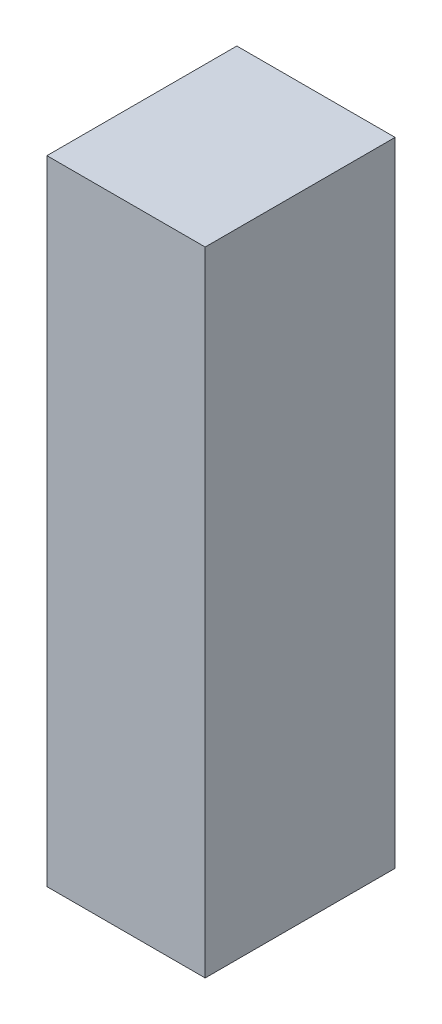
ISO-10303-21;
HEADER;
FILE_DESCRIPTION(('STEP AP214'),'2;1');
FILE_NAME('part.step','',(''),(''),'','','');
FILE_SCHEMA(('AUTOMOTIVE_DESIGN { 1 0 10303 214 1 1 1 1 }'));
ENDSEC;
DATA;
#1=APPLICATION_CONTEXT('core data for automotive mechanical design processes');
#2=APPLICATION_PROTOCOL_DEFINITION('international standard','automotive_design',2000,#1);
#3=PRODUCT_CONTEXT('',#1,'mechanical');
#4=PRODUCT('Part','Part','',(#3));
#5=PRODUCT_RELATED_PRODUCT_CATEGORY('part','',(#4));
#6=PRODUCT_DEFINITION_FORMATION('','',#4);
#7=PRODUCT_DEFINITION_CONTEXT('part definition',#1,'design');
#8=PRODUCT_DEFINITION('design','',#6,#7);
#9=PRODUCT_DEFINITION_SHAPE('','',#8);
#10=(LENGTH_UNIT() NAMED_UNIT(*) SI_UNIT(.MILLI.,.METRE.));
#11=(NAMED_UNIT(*) PLANE_ANGLE_UNIT() SI_UNIT($,.RADIAN.));
#12=(NAMED_UNIT(*) SI_UNIT($,.STERADIAN.) SOLID_ANGLE_UNIT());
#13=UNCERTAINTY_MEASURE_WITH_UNIT(LENGTH_MEASURE(1.E-05),#10,'distance_accuracy_value','');
#14=(GEOMETRIC_REPRESENTATION_CONTEXT(3) GLOBAL_UNCERTAINTY_ASSIGNED_CONTEXT((#13)) GLOBAL_UNIT_ASSIGNED_CONTEXT((#10,
#11,#12)) REPRESENTATION_CONTEXT('',''));
#15=CARTESIAN_POINT('',(0.,0.,0.));
#16=DIRECTION('',(0.,0.,1.));
#17=DIRECTION('',(1.,0.,0.));
#18=AXIS2_PLACEMENT_3D('',#15,#16,#17);
#19=CARTESIAN_POINT('',(0.2499995,-0.999998,0.));
#20=DIRECTION('',(-1.,0.,0.));
#21=DIRECTION('',(0.,0.,1.));
#22=AXIS2_PLACEMENT_3D('',#19,#20,#21);
#23=PLANE('',#22);
#24=DIRECTION('',(0.,0.,-1.));
#25=VECTOR('',#24,1.);
#26=CARTESIAN_POINT('',(0.2499995,1.00000054,0.));
#27=LINE('',#26,#25);
#28=CARTESIAN_POINT('',(0.2499995,1.00000054,0.));
#29=VERTEX_POINT('',#28);
#30=CARTESIAN_POINT('',(0.2499995,1.00000054,0.5999988));
#31=VERTEX_POINT('',#30);
#32=EDGE_CURVE('E20',#29,#31,#27,.F.);
#33=ORIENTED_EDGE('',*,*,#32,.T.);
#34=DIRECTION('',(0.,1.,0.));
#35=VECTOR('',#34,1.);
#36=CARTESIAN_POINT('',(0.2499995,1.00000054,0.5999988));
#37=LINE('',#36,#35);
#38=CARTESIAN_POINT('',(0.2499995,-0.999998,0.5999988));
#39=VERTEX_POINT('',#38);
#40=EDGE_CURVE('E55',#31,#39,#37,.F.);
#41=ORIENTED_EDGE('',*,*,#40,.T.);
#42=DIRECTION('',(0.,0.,1.));
#43=VECTOR('',#42,1.);
#44=CARTESIAN_POINT('',(0.2499995,-0.999998,0.));
#45=LINE('',#44,#43);
#46=CARTESIAN_POINT('',(0.2499995,-0.999998,0.));
#47=VERTEX_POINT('',#46);
#48=EDGE_CURVE('E76',#39,#47,#45,.F.);
#49=ORIENTED_EDGE('',*,*,#48,.T.);
#50=DIRECTION('',(0.,1.,0.));
#51=VECTOR('',#50,1.);
#52=CARTESIAN_POINT('',(0.2499995,1.00000054,0.));
#53=LINE('',#52,#51);
#54=EDGE_CURVE('E58',#29,#47,#53,.F.);
#55=ORIENTED_EDGE('',*,*,#54,.F.);
#56=EDGE_LOOP('',(#33,#41,#49,#55));
#57=FACE_BOUND('',#56,.T.);
#58=ADVANCED_FACE('F17',(#57),#23,.F.);
#59=CARTESIAN_POINT('',(0.2499995,1.00000054,0.));
#60=DIRECTION('',(0.,-1.,0.));
#61=DIRECTION('',(0.,0.,-1.));
#62=AXIS2_PLACEMENT_3D('',#59,#60,#61);
#63=PLANE('',#62);
#64=DIRECTION('',(0.,0.,-1.));
#65=VECTOR('',#64,1.);
#66=CARTESIAN_POINT('',(-0.2499995,1.00000054,0.));
#67=LINE('',#66,#65);
#68=CARTESIAN_POINT('',(-0.2499995,1.00000054,0.));
#69=VERTEX_POINT('',#68);
#70=CARTESIAN_POINT('',(-0.2499995,1.00000054,0.5999988));
#71=VERTEX_POINT('',#70);
#72=EDGE_CURVE('E73',#69,#71,#67,.F.);
#73=ORIENTED_EDGE('',*,*,#72,.T.);
#74=DIRECTION('',(-1.,0.,0.));
#75=VECTOR('',#74,1.);
#76=CARTESIAN_POINT('',(-0.2499995,1.00000054,0.5999988));
#77=LINE('',#76,#75);
#78=EDGE_CURVE('E63',#71,#31,#77,.F.);
#79=ORIENTED_EDGE('',*,*,#78,.T.);
#80=ORIENTED_EDGE('',*,*,#32,.F.);
#81=DIRECTION('',(-1.,0.,0.));
#82=VECTOR('',#81,1.);
#83=CARTESIAN_POINT('',(-0.2499995,1.00000054,0.));
#84=LINE('',#83,#82);
#85=EDGE_CURVE('E78',#69,#29,#84,.F.);
#86=ORIENTED_EDGE('',*,*,#85,.F.);
#87=EDGE_LOOP('',(#73,#79,#80,#86));
#88=FACE_BOUND('',#87,.T.);
#89=ADVANCED_FACE('F72',(#88),#63,.F.);
#90=CARTESIAN_POINT('',(-0.2499995,1.00000054,0.5999988));
#91=DIRECTION('',(0.,0.,-1.));
#92=DIRECTION('',(-1.,0.,0.));
#93=AXIS2_PLACEMENT_3D('',#90,#91,#92);
#94=PLANE('',#93);
#95=DIRECTION('',(1.,0.,0.));
#96=VECTOR('',#95,1.);
#97=CARTESIAN_POINT('',(-0.2499995,-0.999998,0.5999988));
#98=LINE('',#97,#96);
#99=CARTESIAN_POINT('',(-0.2499995,-0.999998,0.5999988));
#100=VERTEX_POINT('',#99);
#101=EDGE_CURVE('E69',#100,#39,#98,.T.);
#102=ORIENTED_EDGE('',*,*,#101,.T.);
#103=ORIENTED_EDGE('',*,*,#40,.F.);
#104=ORIENTED_EDGE('',*,*,#78,.F.);
#105=DIRECTION('',(0.,1.,0.));
#106=VECTOR('',#105,1.);
#107=CARTESIAN_POINT('',(-0.2499995,1.00000054,0.5999988));
#108=LINE('',#107,#106);
#109=EDGE_CURVE('E83',#71,#100,#108,.F.);
#110=ORIENTED_EDGE('',*,*,#109,.T.);
#111=EDGE_LOOP('',(#102,#103,#104,#110));
#112=FACE_BOUND('',#111,.T.);
#113=ADVANCED_FACE('F66',(#112),#94,.F.);
#114=CARTESIAN_POINT('',(-0.2499995,-0.999998,0.));
#115=DIRECTION('',(0.,1.,0.));
#116=DIRECTION('',(0.,0.,1.));
#117=AXIS2_PLACEMENT_3D('',#114,#115,#116);
#118=PLANE('',#117);
#119=ORIENTED_EDGE('',*,*,#48,.F.);
#120=ORIENTED_EDGE('',*,*,#101,.F.);
#121=DIRECTION('',(0.,0.,-1.));
#122=VECTOR('',#121,1.);
#123=CARTESIAN_POINT('',(-0.2499995,-0.999998,0.));
#124=LINE('',#123,#122);
#125=CARTESIAN_POINT('',(-0.2499995,-0.999998,0.));
#126=VERTEX_POINT('',#125);
#127=EDGE_CURVE('E26',#100,#126,#124,.T.);
#128=ORIENTED_EDGE('',*,*,#127,.T.);
#129=DIRECTION('',(-1.,0.,0.));
#130=VECTOR('',#129,1.);
#131=CARTESIAN_POINT('',(-0.2499995,-0.999998,0.));
#132=LINE('',#131,#130);
#133=EDGE_CURVE('E34',#47,#126,#132,.T.);
#134=ORIENTED_EDGE('',*,*,#133,.F.);
#135=EDGE_LOOP('',(#119,#120,#128,#134));
#136=FACE_BOUND('',#135,.T.);
#137=ADVANCED_FACE('F88',(#136),#118,.F.);
#138=CARTESIAN_POINT('',(-0.2499995,1.00000054,0.));
#139=DIRECTION('',(0.,0.,-1.));
#140=DIRECTION('',(-1.,0.,0.));
#141=AXIS2_PLACEMENT_3D('',#138,#139,#140);
#142=PLANE('',#141);
#143=ORIENTED_EDGE('',*,*,#133,.T.);
#144=DIRECTION('',(0.,1.,0.));
#145=VECTOR('',#144,1.);
#146=CARTESIAN_POINT('',(-0.2499995,1.00000054,0.));
#147=LINE('',#146,#145);
#148=EDGE_CURVE('E11',#126,#69,#147,.T.);
#149=ORIENTED_EDGE('',*,*,#148,.T.);
#150=ORIENTED_EDGE('',*,*,#85,.T.);
#151=ORIENTED_EDGE('',*,*,#54,.T.);
#152=EDGE_LOOP('',(#143,#149,#150,#151));
#153=FACE_BOUND('',#152,.T.);
#154=ADVANCED_FACE('F91',(#153),#142,.T.);
#155=CARTESIAN_POINT('',(-0.2499995,1.00000054,0.));
#156=DIRECTION('',(1.,0.,0.));
#157=DIRECTION('',(0.,0.,-1.));
#158=AXIS2_PLACEMENT_3D('',#155,#156,#157);
#159=PLANE('',#158);
#160=ORIENTED_EDGE('',*,*,#127,.F.);
#161=ORIENTED_EDGE('',*,*,#109,.F.);
#162=ORIENTED_EDGE('',*,*,#72,.F.);
#163=ORIENTED_EDGE('',*,*,#148,.F.);
#164=EDGE_LOOP('',(#160,#161,#162,#163));
#165=FACE_BOUND('',#164,.T.);
#166=ADVANCED_FACE('F90',(#165),#159,.F.);
#167=CLOSED_SHELL('',(#58,#89,#113,#137,#154,#166));
#168=MANIFOLD_SOLID_BREP('B1',#167);
#169=ADVANCED_BREP_SHAPE_REPRESENTATION('',(#18,#168),#14);
#170=SHAPE_DEFINITION_REPRESENTATION(#9,#169);
ENDSEC;
END-ISO-10303-21;
